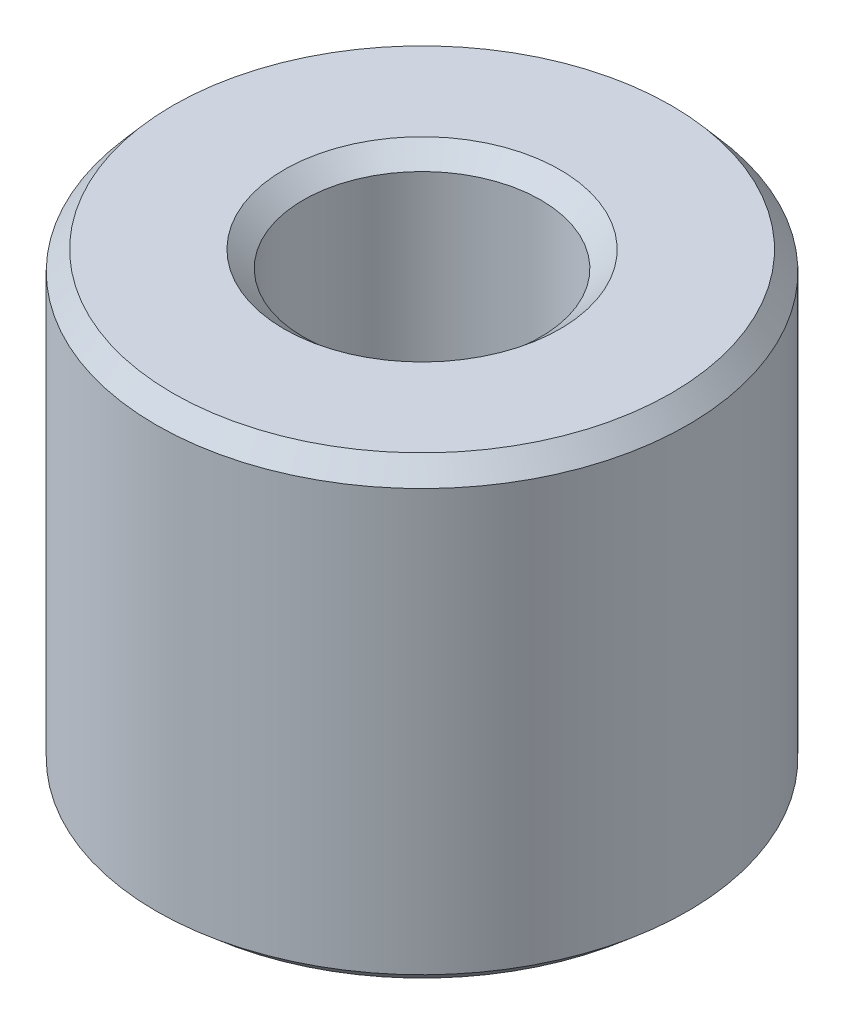
ISO-10303-21;
HEADER;
FILE_DESCRIPTION(('STEP AP214'),'2;1');
FILE_NAME('part.step','',(''),(''),'','','');
FILE_SCHEMA(('AUTOMOTIVE_DESIGN { 1 0 10303 214 1 1 1 1 }'));
ENDSEC;
DATA;
#1=APPLICATION_CONTEXT('core data for automotive mechanical design processes');
#2=APPLICATION_PROTOCOL_DEFINITION('international standard','automotive_design',2000,#1);
#3=PRODUCT_CONTEXT('',#1,'mechanical');
#4=PRODUCT('Part','Part','',(#3));
#5=PRODUCT_RELATED_PRODUCT_CATEGORY('part','',(#4));
#6=PRODUCT_DEFINITION_FORMATION('','',#4);
#7=PRODUCT_DEFINITION_CONTEXT('part definition',#1,'design');
#8=PRODUCT_DEFINITION('design','',#6,#7);
#9=PRODUCT_DEFINITION_SHAPE('','',#8);
#10=(LENGTH_UNIT() NAMED_UNIT(*) SI_UNIT(.MILLI.,.METRE.));
#11=(NAMED_UNIT(*) PLANE_ANGLE_UNIT() SI_UNIT($,.RADIAN.));
#12=(NAMED_UNIT(*) SI_UNIT($,.STERADIAN.) SOLID_ANGLE_UNIT());
#13=UNCERTAINTY_MEASURE_WITH_UNIT(LENGTH_MEASURE(1.E-05),#10,'distance_accuracy_value','');
#14=(GEOMETRIC_REPRESENTATION_CONTEXT(3) GLOBAL_UNCERTAINTY_ASSIGNED_CONTEXT((#13)) GLOBAL_UNIT_ASSIGNED_CONTEXT((#10,
#11,#12)) REPRESENTATION_CONTEXT('',''));
#15=CARTESIAN_POINT('',(0.,0.,0.));
#16=DIRECTION('',(0.,0.,1.));
#17=DIRECTION('',(1.,0.,0.));
#18=AXIS2_PLACEMENT_3D('',#15,#16,#17);
#19=CARTESIAN_POINT('',(0.,77.3543268030497,0.));
#20=DIRECTION('',(0.,-1.,0.));
#21=DIRECTION('',(0.,0.,-1.));
#22=AXIS2_PLACEMENT_3D('',#19,#20,#21);
#23=CYLINDRICAL_SURFACE('',#22,45.);
#24=CARTESIAN_POINT('',(0.,2.79970320919705,0.));
#25=DIRECTION('',(0.,1.,0.));
#26=DIRECTION('',(0.,0.,1.));
#27=AXIS2_PLACEMENT_3D('',#24,#25,#26);
#28=CIRCLE('',#27,45.);
#29=CARTESIAN_POINT('',(0.,2.79970320919705,45.));
#30=VERTEX_POINT('',#29);
#31=EDGE_CURVE('E10',#30,#30,#28,.T.);
#32=ORIENTED_EDGE('',*,*,#31,.T.);
#33=EDGE_LOOP('',(#32));
#34=FACE_BOUND('',#33,.T.);
#35=CARTESIAN_POINT('',(0.,74.0911591649894,0.));
#36=DIRECTION('',(0.,1.,0.));
#37=DIRECTION('',(0.,0.,1.));
#38=AXIS2_PLACEMENT_3D('',#35,#36,#37);
#39=CIRCLE('',#38,45.);
#40=CARTESIAN_POINT('',(0.,74.0911591649894,45.));
#41=VERTEX_POINT('',#40);
#42=EDGE_CURVE('E50',#41,#41,#39,.F.);
#43=ORIENTED_EDGE('',*,*,#42,.T.);
#44=EDGE_LOOP('',(#43));
#45=FACE_BOUND('',#44,.T.);
#46=ADVANCED_FACE('F39',(#34,#45),#23,.T.);
#47=CARTESIAN_POINT('',(0.,77.3543268030497,0.));
#48=DIRECTION('',(0.,1.,0.));
#49=DIRECTION('',(0.,0.,1.));
#50=AXIS2_PLACEMENT_3D('',#47,#48,#49);
#51=PLANE('',#50);
#52=CARTESIAN_POINT('',(0.,77.3543268030497,0.));
#53=DIRECTION('',(0.,1.,0.));
#54=DIRECTION('',(0.,0.,1.));
#55=AXIS2_PLACEMENT_3D('',#52,#53,#54);
#56=CIRCLE('',#55,23.3635283762928);
#57=CARTESIAN_POINT('',(0.,77.3543268030497,23.3635283762928));
#58=VERTEX_POINT('',#57);
#59=EDGE_CURVE('E58',#58,#58,#56,.F.);
#60=ORIENTED_EDGE('',*,*,#59,.T.);
#61=EDGE_LOOP('',(#60));
#62=FACE_BOUND('',#61,.T.);
#63=CARTESIAN_POINT('',(0.,77.3543268030497,0.));
#64=DIRECTION('',(0.,1.,0.));
#65=DIRECTION('',(0.,0.,1.));
#66=AXIS2_PLACEMENT_3D('',#63,#64,#65);
#67=CIRCLE('',#66,42.200296790803);
#68=CARTESIAN_POINT('',(0.,77.3543268030497,42.200296790803));
#69=VERTEX_POINT('',#68);
#70=EDGE_CURVE('E61',#69,#69,#67,.T.);
#71=ORIENTED_EDGE('',*,*,#70,.T.);
#72=EDGE_LOOP('',(#71));
#73=FACE_BOUND('',#72,.T.);
#74=ADVANCED_FACE('F88',(#62,#73),#51,.T.);
#75=CARTESIAN_POINT('',(0.,0.,0.));
#76=DIRECTION('',(0.,1.,0.));
#77=DIRECTION('',(0.,0.,1.));
#78=AXIS2_PLACEMENT_3D('',#75,#76,#77);
#79=PLANE('',#78);
#80=CARTESIAN_POINT('',(0.,0.,0.));
#81=DIRECTION('',(0.,1.,0.));
#82=DIRECTION('',(0.,0.,1.));
#83=AXIS2_PLACEMENT_3D('',#80,#81,#82);
#84=CIRCLE('',#83,22.9000639474296);
#85=CARTESIAN_POINT('',(0.,0.,22.9000639474296));
#86=VERTEX_POINT('',#85);
#87=EDGE_CURVE('E51',#86,#86,#84,.T.);
#88=ORIENTED_EDGE('',*,*,#87,.T.);
#89=EDGE_LOOP('',(#88));
#90=FACE_BOUND('',#89,.T.);
#91=CARTESIAN_POINT('',(0.,0.,0.));
#92=DIRECTION('',(0.,1.,0.));
#93=DIRECTION('',(0.,0.,1.));
#94=AXIS2_PLACEMENT_3D('',#91,#92,#93);
#95=CIRCLE('',#94,41.7368323619397);
#96=CARTESIAN_POINT('',(0.,0.,41.7368323619397));
#97=VERTEX_POINT('',#96);
#98=EDGE_CURVE('E54',#97,#97,#95,.F.);
#99=ORIENTED_EDGE('',*,*,#98,.T.);
#100=EDGE_LOOP('',(#99));
#101=FACE_BOUND('',#100,.T.);
#102=ADVANCED_FACE('F83',(#90,#101),#79,.F.);
#103=CARTESIAN_POINT('',(0.,77.3543268030497,0.));
#104=DIRECTION('',(0.,-1.,0.));
#105=DIRECTION('',(0.,0.,-1.));
#106=AXIS2_PLACEMENT_3D('',#103,#104,#105);
#107=CYLINDRICAL_SURFACE('',#106,20.1003607382325);
#108=CARTESIAN_POINT('',(0.,74.5546235938527,0.));
#109=DIRECTION('',(0.,1.,0.));
#110=DIRECTION('',(0.,0.,1.));
#111=AXIS2_PLACEMENT_3D('',#108,#109,#110);
#112=CIRCLE('',#111,20.1003607382325);
#113=CARTESIAN_POINT('',(0.,74.5546235938527,20.1003607382325));
#114=VERTEX_POINT('',#113);
#115=EDGE_CURVE('E67',#114,#114,#112,.T.);
#116=ORIENTED_EDGE('',*,*,#115,.T.);
#117=EDGE_LOOP('',(#116));
#118=FACE_BOUND('',#117,.T.);
#119=CARTESIAN_POINT('',(0.,3.26316763806027,0.));
#120=DIRECTION('',(0.,1.,0.));
#121=DIRECTION('',(0.,0.,1.));
#122=AXIS2_PLACEMENT_3D('',#119,#120,#121);
#123=CIRCLE('',#122,20.1003607382325);
#124=CARTESIAN_POINT('',(0.,3.26316763806027,20.1003607382325));
#125=VERTEX_POINT('',#124);
#126=EDGE_CURVE('E69',#125,#125,#123,.F.);
#127=ORIENTED_EDGE('',*,*,#126,.T.);
#128=EDGE_LOOP('',(#127));
#129=FACE_BOUND('',#128,.T.);
#130=ADVANCED_FACE('F71',(#118,#129),#107,.F.);
#131=CARTESIAN_POINT('',(0.,74.5546235938527,0.));
#132=DIRECTION('',(0.,1.,0.));
#133=DIRECTION('',(0.,0.,1.));
#134=AXIS2_PLACEMENT_3D('',#131,#132,#133);
#135=CONICAL_SURFACE('',#134,20.1003607382325,0.861692848633612);
#136=ORIENTED_EDGE('',*,*,#59,.F.);
#137=EDGE_LOOP('',(#136));
#138=FACE_BOUND('',#137,.T.);
#139=ORIENTED_EDGE('',*,*,#115,.F.);
#140=EDGE_LOOP('',(#139));
#141=FACE_BOUND('',#140,.T.);
#142=ADVANCED_FACE('F77',(#138,#141),#135,.F.);
#143=CARTESIAN_POINT('',(0.,0.,0.));
#144=DIRECTION('',(0.,-1.,0.));
#145=DIRECTION('',(0.,0.,-1.));
#146=AXIS2_PLACEMENT_3D('',#143,#144,#145);
#147=CONICAL_SURFACE('',#146,22.9000639474296,0.709103478161284);
#148=ORIENTED_EDGE('',*,*,#126,.F.);
#149=EDGE_LOOP('',(#148));
#150=FACE_BOUND('',#149,.T.);
#151=ORIENTED_EDGE('',*,*,#87,.F.);
#152=EDGE_LOOP('',(#151));
#153=FACE_BOUND('',#152,.T.);
#154=ADVANCED_FACE('F73',(#150,#153),#147,.F.);
#155=CARTESIAN_POINT('',(0.,2.79970320919705,0.));
#156=DIRECTION('',(0.,1.,0.));
#157=DIRECTION('',(0.,0.,1.));
#158=AXIS2_PLACEMENT_3D('',#155,#156,#157);
#159=CONICAL_SURFACE('',#158,45.,0.861692848633616);
#160=ORIENTED_EDGE('',*,*,#98,.F.);
#161=EDGE_LOOP('',(#160));
#162=FACE_BOUND('',#161,.T.);
#163=ORIENTED_EDGE('',*,*,#31,.F.);
#164=EDGE_LOOP('',(#163));
#165=FACE_BOUND('',#164,.T.);
#166=ADVANCED_FACE('F76',(#162,#165),#159,.T.);
#167=CARTESIAN_POINT('',(0.,77.3543268030497,0.));
#168=DIRECTION('',(0.,-1.,0.));
#169=DIRECTION('',(0.,0.,-1.));
#170=AXIS2_PLACEMENT_3D('',#167,#168,#169);
#171=CONICAL_SURFACE('',#170,42.200296790803,0.709103478161278);
#172=ORIENTED_EDGE('',*,*,#42,.F.);
#173=EDGE_LOOP('',(#172));
#174=FACE_BOUND('',#173,.T.);
#175=ORIENTED_EDGE('',*,*,#70,.F.);
#176=EDGE_LOOP('',(#175));
#177=FACE_BOUND('',#176,.T.);
#178=ADVANCED_FACE('F45',(#174,#177),#171,.T.);
#179=CLOSED_SHELL('',(#46,#74,#102,#130,#142,#154,#166,#178));
#180=MANIFOLD_SOLID_BREP('B2',#179);
#181=ADVANCED_BREP_SHAPE_REPRESENTATION('',(#18,#180),#14);
#182=SHAPE_DEFINITION_REPRESENTATION(#9,#181);
ENDSEC;
END-ISO-10303-21;
